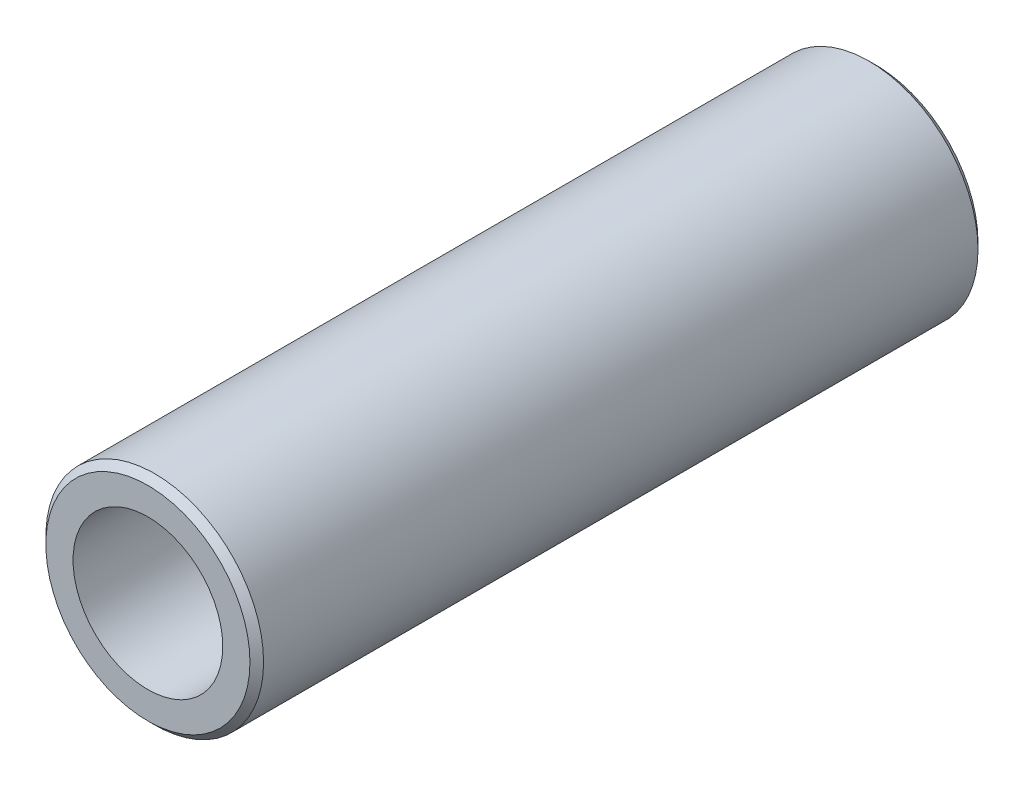
ISO-10303-21;
HEADER;
FILE_DESCRIPTION(('STEP AP214'),'2;1');
FILE_NAME('part.step','',(''),(''),'','','');
FILE_SCHEMA(('AUTOMOTIVE_DESIGN { 1 0 10303 214 1 1 1 1 }'));
ENDSEC;
DATA;
#1=APPLICATION_CONTEXT('core data for automotive mechanical design processes');
#2=APPLICATION_PROTOCOL_DEFINITION('international standard','automotive_design',2000,#1);
#3=PRODUCT_CONTEXT('',#1,'mechanical');
#4=PRODUCT('Part','Part','',(#3));
#5=PRODUCT_RELATED_PRODUCT_CATEGORY('part','',(#4));
#6=PRODUCT_DEFINITION_FORMATION('','',#4);
#7=PRODUCT_DEFINITION_CONTEXT('part definition',#1,'design');
#8=PRODUCT_DEFINITION('design','',#6,#7);
#9=PRODUCT_DEFINITION_SHAPE('','',#8);
#10=(LENGTH_UNIT() NAMED_UNIT(*) SI_UNIT(.MILLI.,.METRE.));
#11=(NAMED_UNIT(*) PLANE_ANGLE_UNIT() SI_UNIT($,.RADIAN.));
#12=(NAMED_UNIT(*) SI_UNIT($,.STERADIAN.) SOLID_ANGLE_UNIT());
#13=UNCERTAINTY_MEASURE_WITH_UNIT(LENGTH_MEASURE(1.E-05),#10,'distance_accuracy_value','');
#14=(GEOMETRIC_REPRESENTATION_CONTEXT(3) GLOBAL_UNCERTAINTY_ASSIGNED_CONTEXT((#13)) GLOBAL_UNIT_ASSIGNED_CONTEXT((#10,
#11,#12)) REPRESENTATION_CONTEXT('',''));
#15=CARTESIAN_POINT('',(0.,0.,0.));
#16=DIRECTION('',(0.,0.,1.));
#17=DIRECTION('',(1.,0.,0.));
#18=AXIS2_PLACEMENT_3D('',#15,#16,#17);
#19=CARTESIAN_POINT('',(0.,0.,26.75));
#20=DIRECTION('',(0.,0.,1.));
#21=DIRECTION('',(1.,0.,0.));
#22=AXIS2_PLACEMENT_3D('',#19,#20,#21);
#23=PLANE('',#22);
#24=CARTESIAN_POINT('',(0.,0.,26.75));
#25=DIRECTION('',(0.,0.,1.));
#26=DIRECTION('',(1.,0.,0.));
#27=AXIS2_PLACEMENT_3D('',#24,#25,#26);
#28=CIRCLE('',#27,7.5);
#29=CARTESIAN_POINT('',(7.5,0.,26.75));
#30=VERTEX_POINT('',#29);
#31=EDGE_CURVE('E10',#30,#30,#28,.T.);
#32=ORIENTED_EDGE('',*,*,#31,.T.);
#33=EDGE_LOOP('',(#32));
#34=FACE_BOUND('',#33,.T.);
#35=CARTESIAN_POINT('',(0.,0.,26.75));
#36=DIRECTION('',(0.,0.,1.));
#37=DIRECTION('',(1.,0.,0.));
#38=AXIS2_PLACEMENT_3D('',#35,#36,#37);
#39=CIRCLE('',#38,5.5);
#40=CARTESIAN_POINT('',(5.5,0.,26.75));
#41=VERTEX_POINT('',#40);
#42=EDGE_CURVE('E56',#41,#41,#39,.T.);
#43=ORIENTED_EDGE('',*,*,#42,.F.);
#44=EDGE_LOOP('',(#43));
#45=FACE_BOUND('',#44,.T.);
#46=ADVANCED_FACE('F35',(#34,#45),#23,.T.);
#47=CARTESIAN_POINT('',(0.,0.,-26.75));
#48=DIRECTION('',(0.,0.,1.));
#49=DIRECTION('',(1.,0.,0.));
#50=AXIS2_PLACEMENT_3D('',#47,#48,#49);
#51=PLANE('',#50);
#52=CARTESIAN_POINT('',(0.,0.,-26.75));
#53=DIRECTION('',(0.,0.,1.));
#54=DIRECTION('',(1.,0.,0.));
#55=AXIS2_PLACEMENT_3D('',#52,#53,#54);
#56=CIRCLE('',#55,7.49999999999999);
#57=CARTESIAN_POINT('',(7.49999999999999,0.,-26.75));
#58=VERTEX_POINT('',#57);
#59=EDGE_CURVE('E43',#58,#58,#56,.F.);
#60=ORIENTED_EDGE('',*,*,#59,.T.);
#61=EDGE_LOOP('',(#60));
#62=FACE_BOUND('',#61,.T.);
#63=CARTESIAN_POINT('',(0.,0.,-26.75));
#64=DIRECTION('',(0.,0.,1.));
#65=DIRECTION('',(1.,0.,0.));
#66=AXIS2_PLACEMENT_3D('',#63,#64,#65);
#67=CIRCLE('',#66,5.5);
#68=CARTESIAN_POINT('',(5.5,0.,-26.75));
#69=VERTEX_POINT('',#68);
#70=EDGE_CURVE('E57',#69,#69,#67,.T.);
#71=ORIENTED_EDGE('',*,*,#70,.T.);
#72=EDGE_LOOP('',(#71));
#73=FACE_BOUND('',#72,.T.);
#74=ADVANCED_FACE('F67',(#62,#73),#51,.F.);
#75=CARTESIAN_POINT('',(0.,0.,26.75));
#76=DIRECTION('',(0.,0.,-1.));
#77=DIRECTION('',(-1.,0.,0.));
#78=AXIS2_PLACEMENT_3D('',#75,#76,#77);
#79=CYLINDRICAL_SURFACE('',#78,8.);
#80=CARTESIAN_POINT('',(0.,0.,-26.25));
#81=DIRECTION('',(0.,0.,1.));
#82=DIRECTION('',(1.,0.,0.));
#83=AXIS2_PLACEMENT_3D('',#80,#81,#82);
#84=CIRCLE('',#83,8.);
#85=CARTESIAN_POINT('',(8.,0.,-26.25));
#86=VERTEX_POINT('',#85);
#87=EDGE_CURVE('E47',#86,#86,#84,.T.);
#88=ORIENTED_EDGE('',*,*,#87,.T.);
#89=EDGE_LOOP('',(#88));
#90=FACE_BOUND('',#89,.T.);
#91=CARTESIAN_POINT('',(0.,0.,26.25));
#92=DIRECTION('',(0.,0.,1.));
#93=DIRECTION('',(1.,0.,0.));
#94=AXIS2_PLACEMENT_3D('',#91,#92,#93);
#95=CIRCLE('',#94,8.);
#96=CARTESIAN_POINT('',(8.,0.,26.25));
#97=VERTEX_POINT('',#96);
#98=EDGE_CURVE('E51',#97,#97,#95,.F.);
#99=ORIENTED_EDGE('',*,*,#98,.T.);
#100=EDGE_LOOP('',(#99));
#101=FACE_BOUND('',#100,.T.);
#102=ADVANCED_FACE('F72',(#90,#101),#79,.T.);
#103=CARTESIAN_POINT('',(0.,0.,26.75));
#104=DIRECTION('',(0.,0.,-1.));
#105=DIRECTION('',(-1.,0.,0.));
#106=AXIS2_PLACEMENT_3D('',#103,#104,#105);
#107=CYLINDRICAL_SURFACE('',#106,5.5);
#108=ORIENTED_EDGE('',*,*,#42,.T.);
#109=EDGE_LOOP('',(#108));
#110=FACE_BOUND('',#109,.T.);
#111=ORIENTED_EDGE('',*,*,#70,.F.);
#112=EDGE_LOOP('',(#111));
#113=FACE_BOUND('',#112,.T.);
#114=ADVANCED_FACE('F63',(#110,#113),#107,.F.);
#115=CARTESIAN_POINT('',(0.,0.,-26.25));
#116=DIRECTION('',(0.,0.,1.));
#117=DIRECTION('',(1.,0.,0.));
#118=AXIS2_PLACEMENT_3D('',#115,#116,#117);
#119=CONICAL_SURFACE('',#118,8.,0.785398163397455);
#120=ORIENTED_EDGE('',*,*,#59,.F.);
#121=EDGE_LOOP('',(#120));
#122=FACE_BOUND('',#121,.T.);
#123=ORIENTED_EDGE('',*,*,#87,.F.);
#124=EDGE_LOOP('',(#123));
#125=FACE_BOUND('',#124,.T.);
#126=ADVANCED_FACE('F79',(#122,#125),#119,.T.);
#127=CARTESIAN_POINT('',(0.,0.,26.75));
#128=DIRECTION('',(0.,0.,-1.));
#129=DIRECTION('',(-1.,0.,0.));
#130=AXIS2_PLACEMENT_3D('',#127,#128,#129);
#131=CONICAL_SURFACE('',#130,7.5,0.785398163397452);
#132=ORIENTED_EDGE('',*,*,#98,.F.);
#133=EDGE_LOOP('',(#132));
#134=FACE_BOUND('',#133,.T.);
#135=ORIENTED_EDGE('',*,*,#31,.F.);
#136=EDGE_LOOP('',(#135));
#137=FACE_BOUND('',#136,.T.);
#138=ADVANCED_FACE('F38',(#134,#137),#131,.T.);
#139=CLOSED_SHELL('',(#46,#74,#102,#114,#126,#138));
#140=MANIFOLD_SOLID_BREP('B2',#139);
#141=ADVANCED_BREP_SHAPE_REPRESENTATION('',(#18,#140),#14);
#142=SHAPE_DEFINITION_REPRESENTATION(#9,#141);
ENDSEC;
END-ISO-10303-21;
